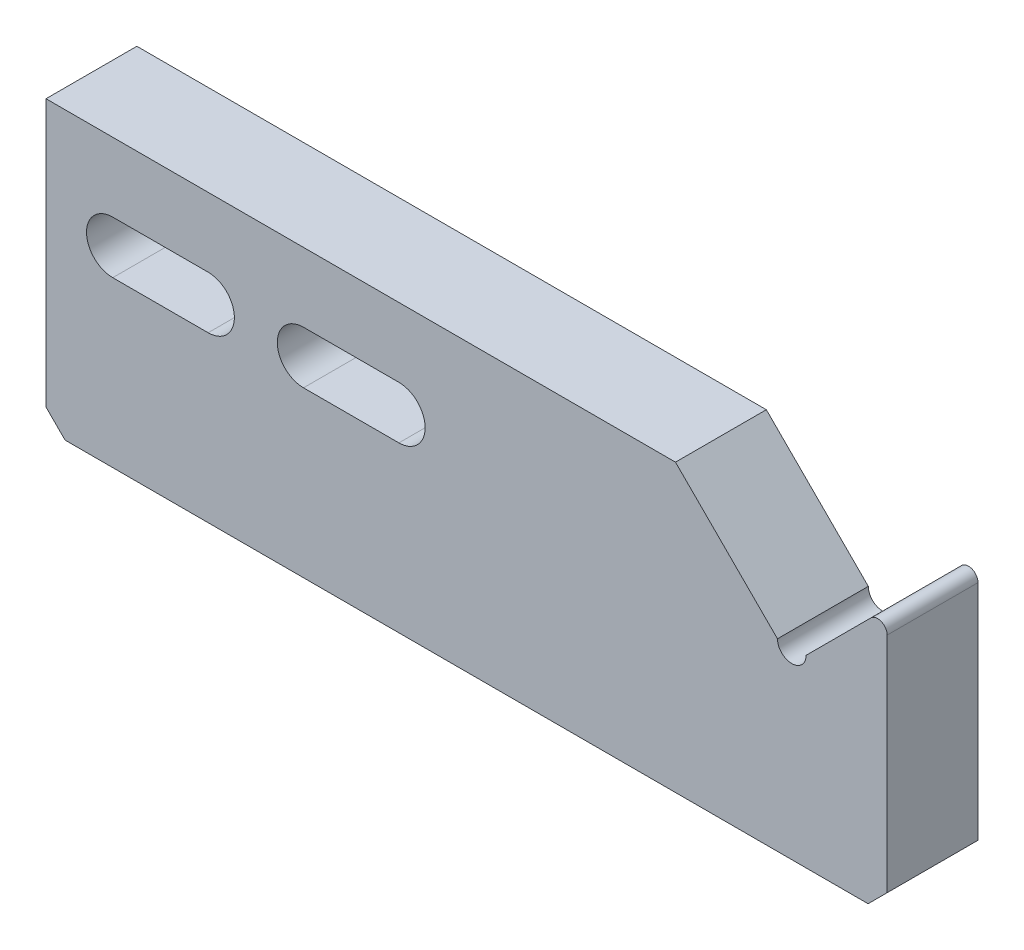
ISO-10303-21;
HEADER;
FILE_DESCRIPTION(('STEP AP214'),'2;1');
FILE_NAME('part.step','',(''),(''),'','','');
FILE_SCHEMA(('AUTOMOTIVE_DESIGN { 1 0 10303 214 1 1 1 1 }'));
ENDSEC;
DATA;
#1=APPLICATION_CONTEXT('core data for automotive mechanical design processes');
#2=APPLICATION_PROTOCOL_DEFINITION('international standard','automotive_design',2000,#1);
#3=PRODUCT_CONTEXT('',#1,'mechanical');
#4=PRODUCT('Part','Part','',(#3));
#5=PRODUCT_RELATED_PRODUCT_CATEGORY('part','',(#4));
#6=PRODUCT_DEFINITION_FORMATION('','',#4);
#7=PRODUCT_DEFINITION_CONTEXT('part definition',#1,'design');
#8=PRODUCT_DEFINITION('design','',#6,#7);
#9=PRODUCT_DEFINITION_SHAPE('','',#8);
#10=(LENGTH_UNIT() NAMED_UNIT(*) SI_UNIT(.MILLI.,.METRE.));
#11=(NAMED_UNIT(*) PLANE_ANGLE_UNIT() SI_UNIT($,.RADIAN.));
#12=(NAMED_UNIT(*) SI_UNIT($,.STERADIAN.) SOLID_ANGLE_UNIT());
#13=UNCERTAINTY_MEASURE_WITH_UNIT(LENGTH_MEASURE(1.E-05),#10,'distance_accuracy_value','');
#14=(GEOMETRIC_REPRESENTATION_CONTEXT(3) GLOBAL_UNCERTAINTY_ASSIGNED_CONTEXT((#13)) GLOBAL_UNIT_ASSIGNED_CONTEXT((#10,
#11,#12)) REPRESENTATION_CONTEXT('',''));
#15=CARTESIAN_POINT('',(0.,0.,0.));
#16=DIRECTION('',(0.,0.,1.));
#17=DIRECTION('',(1.,0.,0.));
#18=AXIS2_PLACEMENT_3D('',#15,#16,#17);
#19=CARTESIAN_POINT('',(-98.1923881554272,239.411254969543,-3.525));
#20=DIRECTION('',(-1.,0.,0.));
#21=DIRECTION('',(0.,0.,1.));
#22=AXIS2_PLACEMENT_3D('',#19,#20,#21);
#23=PLANE('',#22);
#24=CARTESIAN_POINT('',(-98.1923881554272,249.411254969543,1.2375));
#25=DIRECTION('',(-1.,0.,0.));
#26=DIRECTION('',(0.,0.,1.));
#27=AXIS2_PLACEMENT_3D('',#24,#25,#26);
#28=CIRCLE('',#27,2.00000000000002);
#29=CARTESIAN_POINT('',(-98.1923881554272,249.411254969543,3.23750000000002));
#30=VERTEX_POINT('',#29);
#31=EDGE_CURVE('E39',#30,#30,#28,.F.);
#32=ORIENTED_EDGE('',*,*,#31,.T.);
#33=EDGE_LOOP('',(#32));
#34=FACE_BOUND('',#33,.T.);
#35=DIRECTION('',(0.,-1.,0.));
#36=VECTOR('',#35,1.);
#37=CARTESIAN_POINT('',(-98.1923881554272,239.411254969543,-3.525));
#38=LINE('',#37,#36);
#39=CARTESIAN_POINT('',(-98.1923881554272,269.411254969543,-3.525));
#40=VERTEX_POINT('',#39);
#41=CARTESIAN_POINT('',(-98.1923881554272,241.411254969543,-3.525));
#42=VERTEX_POINT('',#41);
#43=EDGE_CURVE('E266',#40,#42,#38,.T.);
#44=ORIENTED_EDGE('',*,*,#43,.T.);
#45=DIRECTION('',(0.,0.,1.));
#46=VECTOR('',#45,1.);
#47=CARTESIAN_POINT('',(-98.1923881554272,241.411254969543,-3.525));
#48=LINE('',#47,#46);
#49=CARTESIAN_POINT('',(-98.1923881554272,241.411254969543,6.));
#50=VERTEX_POINT('',#49);
#51=EDGE_CURVE('E290',#42,#50,#48,.T.);
#52=ORIENTED_EDGE('',*,*,#51,.T.);
#53=DIRECTION('',(0.,-1.,0.));
#54=VECTOR('',#53,1.);
#55=CARTESIAN_POINT('',(-98.1923881554272,239.411254969543,6.));
#56=LINE('',#55,#54);
#57=CARTESIAN_POINT('',(-98.1923881554272,269.411254969543,6.));
#58=VERTEX_POINT('',#57);
#59=EDGE_CURVE('E207',#58,#50,#56,.T.);
#60=ORIENTED_EDGE('',*,*,#59,.F.);
#61=DIRECTION('',(0.,0.,1.));
#62=VECTOR('',#61,1.);
#63=CARTESIAN_POINT('',(-98.1923881554272,269.411254969543,-3.525));
#64=LINE('',#63,#62);
#65=EDGE_CURVE('E272',#40,#58,#64,.T.);
#66=ORIENTED_EDGE('',*,*,#65,.F.);
#67=EDGE_LOOP('',(#44,#52,#60,#66));
#68=FACE_BOUND('',#67,.T.);
#69=ADVANCED_FACE('F31',(#34,#68),#23,.T.);
#70=CARTESIAN_POINT('',(-10.,267.218866814118,-3.525));
#71=DIRECTION('',(1.,0.,0.));
#72=DIRECTION('',(0.,1.,0.));
#73=AXIS2_PLACEMENT_3D('',#70,#71,#72);
#74=PLANE('',#73);
#75=DIRECTION('',(0.,1.,0.));
#76=VECTOR('',#75,1.);
#77=CARTESIAN_POINT('',(-10.,267.218866814118,6.));
#78=LINE('',#77,#76);
#79=CARTESIAN_POINT('',(-10.,241.411254969543,6.));
#80=VERTEX_POINT('',#79);
#81=CARTESIAN_POINT('',(-10.,264.804653251745,6.));
#82=VERTEX_POINT('',#81);
#83=EDGE_CURVE('E194',#80,#82,#78,.T.);
#84=ORIENTED_EDGE('',*,*,#83,.F.);
#85=DIRECTION('',(0.,0.,-1.));
#86=VECTOR('',#85,1.);
#87=CARTESIAN_POINT('',(-10.,241.411254969543,-3.525));
#88=LINE('',#87,#86);
#89=CARTESIAN_POINT('',(-10.,241.411254969543,-3.525));
#90=VERTEX_POINT('',#89);
#91=EDGE_CURVE('E46',#80,#90,#88,.T.);
#92=ORIENTED_EDGE('',*,*,#91,.T.);
#93=DIRECTION('',(0.,1.,0.));
#94=VECTOR('',#93,1.);
#95=CARTESIAN_POINT('',(-10.,267.218866814118,-3.525));
#96=LINE('',#95,#94);
#97=CARTESIAN_POINT('',(-10.,264.804653251745,-3.525));
#98=VERTEX_POINT('',#97);
#99=EDGE_CURVE('E248',#90,#98,#96,.T.);
#100=ORIENTED_EDGE('',*,*,#99,.T.);
#101=DIRECTION('',(0.,0.,1.));
#102=VECTOR('',#101,1.);
#103=CARTESIAN_POINT('',(-10.,264.804653251745,-3.525));
#104=LINE('',#103,#102);
#105=EDGE_CURVE('E274',#98,#82,#104,.T.);
#106=ORIENTED_EDGE('',*,*,#105,.T.);
#107=EDGE_LOOP('',(#84,#92,#100,#106));
#108=FACE_BOUND('',#107,.T.);
#109=ADVANCED_FACE('F316',(#108),#74,.T.);
#110=CARTESIAN_POINT('',(-10.,239.411254969543,-3.525));
#111=DIRECTION('',(0.,-1.,0.));
#112=DIRECTION('',(1.,0.,0.));
#113=AXIS2_PLACEMENT_3D('',#110,#111,#112);
#114=PLANE('',#113);
#115=DIRECTION('',(1.,0.,0.));
#116=VECTOR('',#115,1.);
#117=CARTESIAN_POINT('',(-10.,239.411254969543,6.));
#118=LINE('',#117,#116);
#119=CARTESIAN_POINT('',(-96.1923881554272,239.411254969543,6.));
#120=VERTEX_POINT('',#119);
#121=CARTESIAN_POINT('',(-12.,239.411254969543,6.));
#122=VERTEX_POINT('',#121);
#123=EDGE_CURVE('E210',#120,#122,#118,.T.);
#124=ORIENTED_EDGE('',*,*,#123,.F.);
#125=DIRECTION('',(0.,0.,-1.));
#126=VECTOR('',#125,1.);
#127=CARTESIAN_POINT('',(-96.1923881554272,239.411254969543,-3.525));
#128=LINE('',#127,#126);
#129=CARTESIAN_POINT('',(-96.1923881554272,239.411254969543,-3.525));
#130=VERTEX_POINT('',#129);
#131=EDGE_CURVE('E300',#120,#130,#128,.T.);
#132=ORIENTED_EDGE('',*,*,#131,.T.);
#133=DIRECTION('',(1.,0.,0.));
#134=VECTOR('',#133,1.);
#135=CARTESIAN_POINT('',(-10.,239.411254969543,-3.525));
#136=LINE('',#135,#134);
#137=CARTESIAN_POINT('',(-12.,239.411254969543,-3.525));
#138=VERTEX_POINT('',#137);
#139=EDGE_CURVE('E269',#130,#138,#136,.T.);
#140=ORIENTED_EDGE('',*,*,#139,.T.);
#141=DIRECTION('',(0.,0.,1.));
#142=VECTOR('',#141,1.);
#143=CARTESIAN_POINT('',(-12.,239.411254969543,-3.525));
#144=LINE('',#143,#142);
#145=EDGE_CURVE('E297',#138,#122,#144,.T.);
#146=ORIENTED_EDGE('',*,*,#145,.T.);
#147=EDGE_LOOP('',(#124,#132,#140,#146));
#148=FACE_BOUND('',#147,.T.);
#149=ADVANCED_FACE('F321',(#148),#114,.T.);
#150=CARTESIAN_POINT('',(-98.1923881554272,269.411254969543,-3.525));
#151=DIRECTION('',(0.,1.,0.));
#152=DIRECTION('',(0.,0.,1.));
#153=AXIS2_PLACEMENT_3D('',#150,#151,#152);
#154=PLANE('',#153);
#155=ORIENTED_EDGE('',*,*,#65,.T.);
#156=DIRECTION('',(-1.,0.,0.));
#157=VECTOR('',#156,1.);
#158=CARTESIAN_POINT('',(-98.1923881554272,269.411254969543,6.));
#159=LINE('',#158,#157);
#160=CARTESIAN_POINT('',(-32.1923881554272,269.411254969543,6.));
#161=VERTEX_POINT('',#160);
#162=EDGE_CURVE('E204',#161,#58,#159,.T.);
#163=ORIENTED_EDGE('',*,*,#162,.F.);
#164=DIRECTION('',(0.,0.,1.));
#165=VECTOR('',#164,1.);
#166=CARTESIAN_POINT('',(-32.1923881554272,269.411254969543,-3.525));
#167=LINE('',#166,#165);
#168=CARTESIAN_POINT('',(-32.1923881554272,269.411254969543,-3.525));
#169=VERTEX_POINT('',#168);
#170=EDGE_CURVE('E275',#169,#161,#167,.T.);
#171=ORIENTED_EDGE('',*,*,#170,.F.);
#172=DIRECTION('',(-1.,0.,0.));
#173=VECTOR('',#172,1.);
#174=CARTESIAN_POINT('',(-98.1923881554272,269.411254969543,-3.525));
#175=LINE('',#174,#173);
#176=EDGE_CURVE('E263',#169,#40,#175,.T.);
#177=ORIENTED_EDGE('',*,*,#176,.T.);
#178=EDGE_LOOP('',(#155,#163,#171,#177));
#179=FACE_BOUND('',#178,.T.);
#180=ADVANCED_FACE('F326',(#179),#154,.T.);
#181=CARTESIAN_POINT('',(-32.1923881554272,269.411254969543,-3.525));
#182=DIRECTION('',(0.70710678118657,0.707106781186525,0.));
#183=DIRECTION('',(-0.707106781186525,0.70710678118657,0.));
#184=AXIS2_PLACEMENT_3D('',#181,#182,#183);
#185=PLANE('',#184);
#186=ORIENTED_EDGE('',*,*,#170,.T.);
#187=DIRECTION('',(-0.707106781186525,0.70710678118657,0.));
#188=VECTOR('',#187,1.);
#189=CARTESIAN_POINT('',(-32.1923881554272,269.411254969543,6.));
#190=LINE('',#189,#188);
#191=CARTESIAN_POINT('',(-21.5000000000015,258.718866814116,6.));
#192=VERTEX_POINT('',#191);
#193=EDGE_CURVE('E201',#192,#161,#190,.T.);
#194=ORIENTED_EDGE('',*,*,#193,.F.);
#195=DIRECTION('',(0.,0.,1.));
#196=VECTOR('',#195,1.);
#197=CARTESIAN_POINT('',(-21.5000000000015,258.718866814116,-3.525));
#198=LINE('',#197,#196);
#199=CARTESIAN_POINT('',(-21.5000000000015,258.718866814116,-3.525));
#200=VERTEX_POINT('',#199);
#201=EDGE_CURVE('E277',#200,#192,#198,.T.);
#202=ORIENTED_EDGE('',*,*,#201,.F.);
#203=DIRECTION('',(-0.707106781186525,0.70710678118657,0.));
#204=VECTOR('',#203,1.);
#205=CARTESIAN_POINT('',(-32.1923881554272,269.411254969543,-3.525));
#206=LINE('',#205,#204);
#207=EDGE_CURVE('E260',#200,#169,#206,.T.);
#208=ORIENTED_EDGE('',*,*,#207,.T.);
#209=EDGE_LOOP('',(#186,#194,#202,#208));
#210=FACE_BOUND('',#209,.T.);
#211=ADVANCED_FACE('F329',(#210),#185,.T.);
#212=CARTESIAN_POINT('',(-20.0000000000015,258.718866814116,-3.525));
#213=DIRECTION('',(0.,0.,1.));
#214=DIRECTION('',(1.,0.,0.));
#215=AXIS2_PLACEMENT_3D('',#212,#213,#214);
#216=CYLINDRICAL_SURFACE('',#215,1.5);
#217=ORIENTED_EDGE('',*,*,#201,.T.);
#218=CARTESIAN_POINT('',(-20.0000000000015,258.718866814116,6.));
#219=DIRECTION('',(0.,0.,-1.));
#220=DIRECTION('',(1.,0.,0.));
#221=AXIS2_PLACEMENT_3D('',#218,#219,#220);
#222=CIRCLE('',#221,1.5);
#223=CARTESIAN_POINT('',(-18.5000000000015,258.718866814116,6.));
#224=VERTEX_POINT('',#223);
#225=EDGE_CURVE('E198',#224,#192,#222,.T.);
#226=ORIENTED_EDGE('',*,*,#225,.F.);
#227=DIRECTION('',(0.,0.,1.));
#228=VECTOR('',#227,1.);
#229=CARTESIAN_POINT('',(-18.5000000000015,258.718866814116,-3.525));
#230=LINE('',#229,#228);
#231=CARTESIAN_POINT('',(-18.5000000000015,258.718866814116,-3.525));
#232=VERTEX_POINT('',#231);
#233=EDGE_CURVE('E271',#232,#224,#230,.T.);
#234=ORIENTED_EDGE('',*,*,#233,.F.);
#235=CARTESIAN_POINT('',(-20.0000000000015,258.718866814116,-3.525));
#236=DIRECTION('',(0.,0.,-1.));
#237=DIRECTION('',(1.,0.,0.));
#238=AXIS2_PLACEMENT_3D('',#235,#236,#237);
#239=CIRCLE('',#238,1.5);
#240=EDGE_CURVE('E257',#232,#200,#239,.T.);
#241=ORIENTED_EDGE('',*,*,#240,.T.);
#242=EDGE_LOOP('',(#217,#226,#234,#241));
#243=FACE_BOUND('',#242,.T.);
#244=ADVANCED_FACE('F333',(#243),#216,.F.);
#245=CARTESIAN_POINT('',(-10.,267.218866814118,-3.525));
#246=DIRECTION('',(-0.707106781186548,0.707106781186547,0.));
#247=DIRECTION('',(-0.707106781186547,-0.707106781186548,0.));
#248=AXIS2_PLACEMENT_3D('',#245,#246,#247);
#249=PLANE('',#248);
#250=DIRECTION('',(-0.707106781186547,-0.707106781186548,0.));
#251=VECTOR('',#250,1.);
#252=CARTESIAN_POINT('',(-10.,267.218866814118,6.));
#253=LINE('',#252,#251);
#254=CARTESIAN_POINT('',(-11.7071067811866,265.511760032931,6.));
#255=VERTEX_POINT('',#254);
#256=EDGE_CURVE('E196',#255,#224,#253,.T.);
#257=ORIENTED_EDGE('',*,*,#256,.F.);
#258=DIRECTION('',(0.,0.,1.));
#259=VECTOR('',#258,1.);
#260=CARTESIAN_POINT('',(-11.7071067811866,265.511760032931,-3.525));
#261=LINE('',#260,#259);
#262=CARTESIAN_POINT('',(-11.7071067811866,265.511760032931,-3.525));
#263=VERTEX_POINT('',#262);
#264=EDGE_CURVE('E285',#255,#263,#261,.F.);
#265=ORIENTED_EDGE('',*,*,#264,.T.);
#266=DIRECTION('',(-0.707106781186547,-0.707106781186548,0.));
#267=VECTOR('',#266,1.);
#268=CARTESIAN_POINT('',(-10.,267.218866814118,-3.525));
#269=LINE('',#268,#267);
#270=EDGE_CURVE('E255',#263,#232,#269,.T.);
#271=ORIENTED_EDGE('',*,*,#270,.T.);
#272=ORIENTED_EDGE('',*,*,#233,.T.);
#273=EDGE_LOOP('',(#257,#265,#271,#272));
#274=FACE_BOUND('',#273,.T.);
#275=ADVANCED_FACE('F337',(#274),#249,.T.);
#276=CARTESIAN_POINT('',(-20.0000000000015,258.718866814116,-3.525));
#277=DIRECTION('',(0.,0.,1.));
#278=DIRECTION('',(1.,0.,0.));
#279=AXIS2_PLACEMENT_3D('',#276,#277,#278);
#280=PLANE('',#279);
#281=DIRECTION('',(1.,0.,0.));
#282=VECTOR('',#281,1.);
#283=CARTESIAN_POINT('',(-61.1923881554272,256.661254969543,-3.525));
#284=LINE('',#283,#282);
#285=CARTESIAN_POINT('',(-71.1923881554272,256.661254969543,-3.525));
#286=VERTEX_POINT('',#285);
#287=CARTESIAN_POINT('',(-61.1923881554272,256.661254969543,-3.525));
#288=VERTEX_POINT('',#287);
#289=EDGE_CURVE('E222',#286,#288,#284,.T.);
#290=ORIENTED_EDGE('',*,*,#289,.T.);
#291=CARTESIAN_POINT('',(-61.1923881554272,259.411254969543,-3.525));
#292=DIRECTION('',(0.,0.,1.));
#293=DIRECTION('',(1.,0.,0.));
#294=AXIS2_PLACEMENT_3D('',#291,#292,#293);
#295=CIRCLE('',#294,2.75);
#296=CARTESIAN_POINT('',(-61.1923881554272,262.161254969543,-3.525));
#297=VERTEX_POINT('',#296);
#298=EDGE_CURVE('E213',#288,#297,#295,.T.);
#299=ORIENTED_EDGE('',*,*,#298,.T.);
#300=DIRECTION('',(-1.,0.,0.));
#301=VECTOR('',#300,1.);
#302=CARTESIAN_POINT('',(-61.1923881554272,262.161254969543,-3.525));
#303=LINE('',#302,#301);
#304=CARTESIAN_POINT('',(-71.1923881554272,262.161254969543,-3.525));
#305=VERTEX_POINT('',#304);
#306=EDGE_CURVE('E216',#297,#305,#303,.T.);
#307=ORIENTED_EDGE('',*,*,#306,.T.);
#308=CARTESIAN_POINT('',(-71.1923881554272,259.411254969543,-3.525));
#309=DIRECTION('',(0.,0.,1.));
#310=DIRECTION('',(1.,0.,0.));
#311=AXIS2_PLACEMENT_3D('',#308,#309,#310);
#312=CIRCLE('',#311,2.75000000000003);
#313=EDGE_CURVE('E219',#305,#286,#312,.T.);
#314=ORIENTED_EDGE('',*,*,#313,.T.);
#315=EDGE_LOOP('',(#290,#299,#307,#314));
#316=FACE_BOUND('',#315,.T.);
#317=DIRECTION('',(1.,0.,0.));
#318=VECTOR('',#317,1.);
#319=CARTESIAN_POINT('',(-81.1923881554272,256.661254969543,-3.525));
#320=LINE('',#319,#318);
#321=CARTESIAN_POINT('',(-91.1923881554272,256.661254969543,-3.525));
#322=VERTEX_POINT('',#321);
#323=CARTESIAN_POINT('',(-81.1923881554272,256.661254969543,-3.525));
#324=VERTEX_POINT('',#323);
#325=EDGE_CURVE('E242',#322,#324,#320,.T.);
#326=ORIENTED_EDGE('',*,*,#325,.T.);
#327=CARTESIAN_POINT('',(-81.1923881554272,259.411254969543,-3.525));
#328=DIRECTION('',(0.,0.,1.));
#329=DIRECTION('',(1.,0.,0.));
#330=AXIS2_PLACEMENT_3D('',#327,#328,#329);
#331=CIRCLE('',#330,2.75000000000003);
#332=CARTESIAN_POINT('',(-81.1923881554272,262.161254969543,-3.525));
#333=VERTEX_POINT('',#332);
#334=EDGE_CURVE('E228',#324,#333,#331,.T.);
#335=ORIENTED_EDGE('',*,*,#334,.T.);
#336=DIRECTION('',(-1.,0.,0.));
#337=VECTOR('',#336,1.);
#338=CARTESIAN_POINT('',(-81.1923881554272,262.161254969543,-3.525));
#339=LINE('',#338,#337);
#340=CARTESIAN_POINT('',(-91.1923881554272,262.161254969543,-3.525));
#341=VERTEX_POINT('',#340);
#342=EDGE_CURVE('E236',#333,#341,#339,.T.);
#343=ORIENTED_EDGE('',*,*,#342,.T.);
#344=CARTESIAN_POINT('',(-91.1923881554272,259.411254969543,-3.525));
#345=DIRECTION('',(0.,0.,1.));
#346=DIRECTION('',(1.,0.,0.));
#347=AXIS2_PLACEMENT_3D('',#344,#345,#346);
#348=CIRCLE('',#347,2.75000000000003);
#349=EDGE_CURVE('E239',#341,#322,#348,.T.);
#350=ORIENTED_EDGE('',*,*,#349,.T.);
#351=EDGE_LOOP('',(#326,#335,#343,#350));
#352=FACE_BOUND('',#351,.T.);
#353=ORIENTED_EDGE('',*,*,#139,.F.);
#354=DIRECTION('',(0.707106781186548,-0.707106781186548,0.));
#355=VECTOR('',#354,1.);
#356=CARTESIAN_POINT('',(-98.1923881554272,241.411254969543,-3.525));
#357=LINE('',#356,#355);
#358=EDGE_CURVE('E303',#130,#42,#357,.F.);
#359=ORIENTED_EDGE('',*,*,#358,.T.);
#360=ORIENTED_EDGE('',*,*,#43,.F.);
#361=ORIENTED_EDGE('',*,*,#176,.F.);
#362=ORIENTED_EDGE('',*,*,#207,.F.);
#363=ORIENTED_EDGE('',*,*,#240,.F.);
#364=ORIENTED_EDGE('',*,*,#270,.F.);
#365=CARTESIAN_POINT('',(-11.,264.804653251745,-3.525));
#366=DIRECTION('',(0.,0.,1.));
#367=DIRECTION('',(1.,0.,0.));
#368=AXIS2_PLACEMENT_3D('',#365,#366,#367);
#369=CIRCLE('',#368,1.);
#370=EDGE_CURVE('E287',#263,#98,#369,.F.);
#371=ORIENTED_EDGE('',*,*,#370,.T.);
#372=ORIENTED_EDGE('',*,*,#99,.F.);
#373=DIRECTION('',(0.707106781186548,0.707106781186548,0.));
#374=VECTOR('',#373,1.);
#375=CARTESIAN_POINT('',(-12.,239.411254969543,-3.525));
#376=LINE('',#375,#374);
#377=EDGE_CURVE('E53',#90,#138,#376,.F.);
#378=ORIENTED_EDGE('',*,*,#377,.T.);
#379=EDGE_LOOP('',(#353,#359,#360,#361,#362,#363,#364,#371,#372,#378));
#380=FACE_BOUND('',#379,.T.);
#381=ADVANCED_FACE('F340',(#316,#352,#380),#280,.F.);
#382=CARTESIAN_POINT('',(-81.1923881554272,259.411254969543,-3.525));
#383=DIRECTION('',(0.,0.,1.));
#384=DIRECTION('',(1.,0.,0.));
#385=AXIS2_PLACEMENT_3D('',#382,#383,#384);
#386=CYLINDRICAL_SURFACE('',#385,2.75000000000003);
#387=DIRECTION('',(0.,0.,1.));
#388=VECTOR('',#387,1.);
#389=CARTESIAN_POINT('',(-81.1923881554272,256.661254969543,-3.525));
#390=LINE('',#389,#388);
#391=CARTESIAN_POINT('',(-81.1923881554272,256.661254969543,6.));
#392=VERTEX_POINT('',#391);
#393=EDGE_CURVE('E246',#324,#392,#390,.T.);
#394=ORIENTED_EDGE('',*,*,#393,.T.);
#395=CARTESIAN_POINT('',(-81.1923881554272,259.411254969543,6.));
#396=DIRECTION('',(0.,0.,1.));
#397=DIRECTION('',(1.,0.,0.));
#398=AXIS2_PLACEMENT_3D('',#395,#396,#397);
#399=CIRCLE('',#398,2.75000000000003);
#400=CARTESIAN_POINT('',(-81.1923881554272,262.161254969543,6.));
#401=VERTEX_POINT('',#400);
#402=EDGE_CURVE('E182',#392,#401,#399,.T.);
#403=ORIENTED_EDGE('',*,*,#402,.T.);
#404=DIRECTION('',(0.,0.,1.));
#405=VECTOR('',#404,1.);
#406=CARTESIAN_POINT('',(-81.1923881554272,262.161254969543,-3.525));
#407=LINE('',#406,#405);
#408=EDGE_CURVE('E245',#333,#401,#407,.T.);
#409=ORIENTED_EDGE('',*,*,#408,.F.);
#410=ORIENTED_EDGE('',*,*,#334,.F.);
#411=EDGE_LOOP('',(#394,#403,#409,#410));
#412=FACE_BOUND('',#411,.T.);
#413=ADVANCED_FACE('F383',(#412),#386,.F.);
#414=CARTESIAN_POINT('',(-81.1923881554272,256.661254969543,-3.525));
#415=DIRECTION('',(0.,-1.,0.));
#416=DIRECTION('',(0.,0.,-1.));
#417=AXIS2_PLACEMENT_3D('',#414,#415,#416);
#418=PLANE('',#417);
#419=DIRECTION('',(0.,0.,1.));
#420=VECTOR('',#419,1.);
#421=CARTESIAN_POINT('',(-91.1923881554272,256.661254969543,-3.525));
#422=LINE('',#421,#420);
#423=CARTESIAN_POINT('',(-91.1923881554272,256.661254969543,6.));
#424=VERTEX_POINT('',#423);
#425=EDGE_CURVE('E249',#322,#424,#422,.T.);
#426=ORIENTED_EDGE('',*,*,#425,.T.);
#427=DIRECTION('',(1.,0.,0.));
#428=VECTOR('',#427,1.);
#429=CARTESIAN_POINT('',(-81.1923881554272,256.661254969543,6.));
#430=LINE('',#429,#428);
#431=EDGE_CURVE('E191',#424,#392,#430,.T.);
#432=ORIENTED_EDGE('',*,*,#431,.T.);
#433=ORIENTED_EDGE('',*,*,#393,.F.);
#434=ORIENTED_EDGE('',*,*,#325,.F.);
#435=EDGE_LOOP('',(#426,#432,#433,#434));
#436=FACE_BOUND('',#435,.T.);
#437=ADVANCED_FACE('F388',(#436),#418,.F.);
#438=CARTESIAN_POINT('',(-91.1923881554272,259.411254969543,-3.525));
#439=DIRECTION('',(0.,0.,1.));
#440=DIRECTION('',(1.,0.,0.));
#441=AXIS2_PLACEMENT_3D('',#438,#439,#440);
#442=CYLINDRICAL_SURFACE('',#441,2.75000000000003);
#443=DIRECTION('',(0.,0.,1.));
#444=VECTOR('',#443,1.);
#445=CARTESIAN_POINT('',(-91.1923881554272,262.161254969543,-3.525));
#446=LINE('',#445,#444);
#447=CARTESIAN_POINT('',(-91.1923881554272,262.161254969543,6.));
#448=VERTEX_POINT('',#447);
#449=EDGE_CURVE('E251',#341,#448,#446,.T.);
#450=ORIENTED_EDGE('',*,*,#449,.T.);
#451=CARTESIAN_POINT('',(-91.1923881554272,259.411254969543,6.));
#452=DIRECTION('',(0.,0.,1.));
#453=DIRECTION('',(1.,0.,0.));
#454=AXIS2_PLACEMENT_3D('',#451,#452,#453);
#455=CIRCLE('',#454,2.75000000000003);
#456=EDGE_CURVE('E188',#448,#424,#455,.T.);
#457=ORIENTED_EDGE('',*,*,#456,.T.);
#458=ORIENTED_EDGE('',*,*,#425,.F.);
#459=ORIENTED_EDGE('',*,*,#349,.F.);
#460=EDGE_LOOP('',(#450,#457,#458,#459));
#461=FACE_BOUND('',#460,.T.);
#462=ADVANCED_FACE('F397',(#461),#442,.F.);
#463=CARTESIAN_POINT('',(-81.1923881554272,262.161254969543,-3.525));
#464=DIRECTION('',(0.,1.,0.));
#465=DIRECTION('',(0.,0.,1.));
#466=AXIS2_PLACEMENT_3D('',#463,#464,#465);
#467=PLANE('',#466);
#468=ORIENTED_EDGE('',*,*,#408,.T.);
#469=DIRECTION('',(-1.,0.,0.));
#470=VECTOR('',#469,1.);
#471=CARTESIAN_POINT('',(-81.1923881554272,262.161254969543,6.));
#472=LINE('',#471,#470);
#473=EDGE_CURVE('E185',#401,#448,#472,.T.);
#474=ORIENTED_EDGE('',*,*,#473,.T.);
#475=ORIENTED_EDGE('',*,*,#449,.F.);
#476=ORIENTED_EDGE('',*,*,#342,.F.);
#477=EDGE_LOOP('',(#468,#474,#475,#476));
#478=FACE_BOUND('',#477,.T.);
#479=ADVANCED_FACE('F393',(#478),#467,.F.);
#480=CARTESIAN_POINT('',(-61.1923881554272,259.411254969543,-3.525));
#481=DIRECTION('',(0.,0.,1.));
#482=DIRECTION('',(1.,0.,0.));
#483=AXIS2_PLACEMENT_3D('',#480,#481,#482);
#484=CYLINDRICAL_SURFACE('',#483,2.75);
#485=DIRECTION('',(0.,0.,1.));
#486=VECTOR('',#485,1.);
#487=CARTESIAN_POINT('',(-61.1923881554272,256.661254969543,-3.525));
#488=LINE('',#487,#486);
#489=CARTESIAN_POINT('',(-61.1923881554272,256.661254969543,6.));
#490=VERTEX_POINT('',#489);
#491=EDGE_CURVE('E226',#288,#490,#488,.T.);
#492=ORIENTED_EDGE('',*,*,#491,.T.);
#493=CARTESIAN_POINT('',(-61.1923881554272,259.411254969543,6.));
#494=DIRECTION('',(0.,0.,1.));
#495=DIRECTION('',(1.,0.,0.));
#496=AXIS2_PLACEMENT_3D('',#493,#494,#495);
#497=CIRCLE('',#496,2.75);
#498=CARTESIAN_POINT('',(-61.1923881554272,262.161254969543,6.));
#499=VERTEX_POINT('',#498);
#500=EDGE_CURVE('E168',#490,#499,#497,.T.);
#501=ORIENTED_EDGE('',*,*,#500,.T.);
#502=DIRECTION('',(0.,0.,1.));
#503=VECTOR('',#502,1.);
#504=CARTESIAN_POINT('',(-61.1923881554272,262.161254969543,-3.525));
#505=LINE('',#504,#503);
#506=EDGE_CURVE('E225',#297,#499,#505,.T.);
#507=ORIENTED_EDGE('',*,*,#506,.F.);
#508=ORIENTED_EDGE('',*,*,#298,.F.);
#509=EDGE_LOOP('',(#492,#501,#507,#508));
#510=FACE_BOUND('',#509,.T.);
#511=ADVANCED_FACE('F396',(#510),#484,.F.);
#512=CARTESIAN_POINT('',(-61.1923881554272,256.661254969543,-3.525));
#513=DIRECTION('',(0.,-1.,0.));
#514=DIRECTION('',(0.,0.,-1.));
#515=AXIS2_PLACEMENT_3D('',#512,#513,#514);
#516=PLANE('',#515);
#517=DIRECTION('',(0.,0.,1.));
#518=VECTOR('',#517,1.);
#519=CARTESIAN_POINT('',(-71.1923881554272,256.661254969543,-3.525));
#520=LINE('',#519,#518);
#521=CARTESIAN_POINT('',(-71.1923881554272,256.661254969543,6.));
#522=VERTEX_POINT('',#521);
#523=EDGE_CURVE('E229',#286,#522,#520,.T.);
#524=ORIENTED_EDGE('',*,*,#523,.T.);
#525=DIRECTION('',(1.,0.,0.));
#526=VECTOR('',#525,1.);
#527=CARTESIAN_POINT('',(-61.1923881554272,256.661254969543,6.));
#528=LINE('',#527,#526);
#529=EDGE_CURVE('E179',#522,#490,#528,.T.);
#530=ORIENTED_EDGE('',*,*,#529,.T.);
#531=ORIENTED_EDGE('',*,*,#491,.F.);
#532=ORIENTED_EDGE('',*,*,#289,.F.);
#533=EDGE_LOOP('',(#524,#530,#531,#532));
#534=FACE_BOUND('',#533,.T.);
#535=ADVANCED_FACE('F407',(#534),#516,.F.);
#536=CARTESIAN_POINT('',(-71.1923881554272,259.411254969543,-3.525));
#537=DIRECTION('',(0.,0.,1.));
#538=DIRECTION('',(1.,0.,0.));
#539=AXIS2_PLACEMENT_3D('',#536,#537,#538);
#540=CYLINDRICAL_SURFACE('',#539,2.75000000000003);
#541=DIRECTION('',(0.,0.,1.));
#542=VECTOR('',#541,1.);
#543=CARTESIAN_POINT('',(-71.1923881554272,262.161254969543,-3.525));
#544=LINE('',#543,#542);
#545=CARTESIAN_POINT('',(-71.1923881554272,262.161254969543,6.));
#546=VERTEX_POINT('',#545);
#547=EDGE_CURVE('E231',#305,#546,#544,.T.);
#548=ORIENTED_EDGE('',*,*,#547,.T.);
#549=CARTESIAN_POINT('',(-71.1923881554272,259.411254969543,6.));
#550=DIRECTION('',(0.,0.,1.));
#551=DIRECTION('',(1.,0.,0.));
#552=AXIS2_PLACEMENT_3D('',#549,#550,#551);
#553=CIRCLE('',#552,2.75000000000003);
#554=EDGE_CURVE('E176',#546,#522,#553,.T.);
#555=ORIENTED_EDGE('',*,*,#554,.T.);
#556=ORIENTED_EDGE('',*,*,#523,.F.);
#557=ORIENTED_EDGE('',*,*,#313,.F.);
#558=EDGE_LOOP('',(#548,#555,#556,#557));
#559=FACE_BOUND('',#558,.T.);
#560=ADVANCED_FACE('F412',(#559),#540,.F.);
#561=CARTESIAN_POINT('',(-61.1923881554272,262.161254969543,-3.525));
#562=DIRECTION('',(0.,1.,0.));
#563=DIRECTION('',(-1.,0.,0.));
#564=AXIS2_PLACEMENT_3D('',#561,#562,#563);
#565=PLANE('',#564);
#566=ORIENTED_EDGE('',*,*,#506,.T.);
#567=DIRECTION('',(-1.,0.,0.));
#568=VECTOR('',#567,1.);
#569=CARTESIAN_POINT('',(-61.1923881554272,262.161254969543,6.));
#570=LINE('',#569,#568);
#571=EDGE_CURVE('E171',#499,#546,#570,.T.);
#572=ORIENTED_EDGE('',*,*,#571,.T.);
#573=ORIENTED_EDGE('',*,*,#547,.F.);
#574=ORIENTED_EDGE('',*,*,#306,.F.);
#575=EDGE_LOOP('',(#566,#572,#573,#574));
#576=FACE_BOUND('',#575,.T.);
#577=ADVANCED_FACE('F409',(#576),#565,.F.);
#578=CARTESIAN_POINT('',(-20.0000000000015,258.718866814116,6.));
#579=DIRECTION('',(0.,0.,1.));
#580=DIRECTION('',(1.,0.,0.));
#581=AXIS2_PLACEMENT_3D('',#578,#579,#580);
#582=PLANE('',#581);
#583=ORIENTED_EDGE('',*,*,#473,.F.);
#584=ORIENTED_EDGE('',*,*,#402,.F.);
#585=ORIENTED_EDGE('',*,*,#431,.F.);
#586=ORIENTED_EDGE('',*,*,#456,.F.);
#587=EDGE_LOOP('',(#583,#584,#585,#586));
#588=FACE_BOUND('',#587,.T.);
#589=ORIENTED_EDGE('',*,*,#59,.T.);
#590=DIRECTION('',(-0.707106781186548,0.707106781186548,0.));
#591=VECTOR('',#590,1.);
#592=CARTESIAN_POINT('',(-67.7500000000011,210.968866814117,6.));
#593=LINE('',#592,#591);
#594=EDGE_CURVE('E295',#50,#120,#593,.F.);
#595=ORIENTED_EDGE('',*,*,#594,.T.);
#596=ORIENTED_EDGE('',*,*,#123,.T.);
#597=DIRECTION('',(-0.707106781186548,-0.707106781186548,0.));
#598=VECTOR('',#597,1.);
#599=CARTESIAN_POINT('',(-6.34619407771401,245.065060891829,6.));
#600=LINE('',#599,#598);
#601=EDGE_CURVE('E293',#122,#80,#600,.F.);
#602=ORIENTED_EDGE('',*,*,#601,.T.);
#603=ORIENTED_EDGE('',*,*,#83,.T.);
#604=CARTESIAN_POINT('',(-11.,264.804653251745,6.));
#605=DIRECTION('',(0.,0.,1.));
#606=DIRECTION('',(1.,0.,0.));
#607=AXIS2_PLACEMENT_3D('',#604,#605,#606);
#608=CIRCLE('',#607,1.);
#609=EDGE_CURVE('E283',#82,#255,#608,.T.);
#610=ORIENTED_EDGE('',*,*,#609,.T.);
#611=ORIENTED_EDGE('',*,*,#256,.T.);
#612=ORIENTED_EDGE('',*,*,#225,.T.);
#613=ORIENTED_EDGE('',*,*,#193,.T.);
#614=ORIENTED_EDGE('',*,*,#162,.T.);
#615=EDGE_LOOP('',(#589,#595,#596,#602,#603,#610,#611,#612,#613,#614));
#616=FACE_BOUND('',#615,.T.);
#617=ORIENTED_EDGE('',*,*,#571,.F.);
#618=ORIENTED_EDGE('',*,*,#500,.F.);
#619=ORIENTED_EDGE('',*,*,#529,.F.);
#620=ORIENTED_EDGE('',*,*,#554,.F.);
#621=EDGE_LOOP('',(#617,#618,#619,#620));
#622=FACE_BOUND('',#621,.T.);
#623=ADVANCED_FACE('F347',(#588,#616,#622),#582,.T.);
#624=CARTESIAN_POINT('',(-11.,264.804653251745,-3.525));
#625=DIRECTION('',(0.,0.,1.));
#626=DIRECTION('',(1.,0.,0.));
#627=AXIS2_PLACEMENT_3D('',#624,#625,#626);
#628=CYLINDRICAL_SURFACE('',#627,1.);
#629=ORIENTED_EDGE('',*,*,#370,.F.);
#630=ORIENTED_EDGE('',*,*,#264,.F.);
#631=ORIENTED_EDGE('',*,*,#609,.F.);
#632=ORIENTED_EDGE('',*,*,#105,.F.);
#633=EDGE_LOOP('',(#629,#630,#631,#632));
#634=FACE_BOUND('',#633,.T.);
#635=ADVANCED_FACE('F343',(#634),#628,.T.);
#636=CARTESIAN_POINT('',(-98.1923881554272,241.411254969543,-3.525));
#637=DIRECTION('',(0.707106781186547,0.707106781186547,0.));
#638=DIRECTION('',(-0.707106781186548,0.707106781186548,0.));
#639=AXIS2_PLACEMENT_3D('',#636,#637,#638);
#640=PLANE('',#639);
#641=ORIENTED_EDGE('',*,*,#358,.F.);
#642=ORIENTED_EDGE('',*,*,#131,.F.);
#643=ORIENTED_EDGE('',*,*,#594,.F.);
#644=ORIENTED_EDGE('',*,*,#51,.F.);
#645=EDGE_LOOP('',(#641,#642,#643,#644));
#646=FACE_BOUND('',#645,.T.);
#647=ADVANCED_FACE('F346',(#646),#640,.F.);
#648=CARTESIAN_POINT('',(-12.,239.411254969543,-3.525));
#649=DIRECTION('',(-0.707106781186547,0.707106781186547,0.));
#650=DIRECTION('',(-0.707106781186548,-0.707106781186548,0.));
#651=AXIS2_PLACEMENT_3D('',#648,#649,#650);
#652=PLANE('',#651);
#653=ORIENTED_EDGE('',*,*,#377,.F.);
#654=ORIENTED_EDGE('',*,*,#91,.F.);
#655=ORIENTED_EDGE('',*,*,#601,.F.);
#656=ORIENTED_EDGE('',*,*,#145,.F.);
#657=EDGE_LOOP('',(#653,#654,#655,#656));
#658=FACE_BOUND('',#657,.T.);
#659=ADVANCED_FACE('F350',(#658),#652,.F.);
#660=CARTESIAN_POINT('',(-98.1923881554272,249.411254969543,1.2375));
#661=DIRECTION('',(1.,0.,0.));
#662=DIRECTION('',(0.,0.,-1.));
#663=AXIS2_PLACEMENT_3D('',#660,#661,#662);
#664=CYLINDRICAL_SURFACE('',#663,1.5);
#665=CARTESIAN_POINT('',(-97.6923881554272,249.411254969543,1.2375));
#666=DIRECTION('',(-1.,0.,0.));
#667=DIRECTION('',(0.,0.,1.));
#668=AXIS2_PLACEMENT_3D('',#665,#666,#667);
#669=CIRCLE('',#668,1.5);
#670=CARTESIAN_POINT('',(-97.6923881554272,249.411254969543,2.7375));
#671=VERTEX_POINT('',#670);
#672=EDGE_CURVE('E11',#671,#671,#669,.T.);
#673=ORIENTED_EDGE('',*,*,#672,.T.);
#674=EDGE_LOOP('',(#673));
#675=FACE_BOUND('',#674,.T.);
#676=CARTESIAN_POINT('',(-78.1923881554272,249.411254969543,1.2375));
#677=DIRECTION('',(1.,0.,0.));
#678=DIRECTION('',(0.,0.,-1.));
#679=AXIS2_PLACEMENT_3D('',#676,#677,#678);
#680=CIRCLE('',#679,1.5);
#681=CARTESIAN_POINT('',(-78.1923881554272,249.411254969543,-0.262500000000001));
#682=VERTEX_POINT('',#681);
#683=EDGE_CURVE('E166',#682,#682,#680,.T.);
#684=ORIENTED_EDGE('',*,*,#683,.T.);
#685=EDGE_LOOP('',(#684));
#686=FACE_BOUND('',#685,.T.);
#687=ADVANCED_FACE('F162',(#675,#686),#664,.F.);
#688=CARTESIAN_POINT('',(-78.1923881554272,249.411254969543,1.2375));
#689=DIRECTION('',(-1.,0.,0.));
#690=DIRECTION('',(0.,0.,1.));
#691=AXIS2_PLACEMENT_3D('',#688,#689,#690);
#692=CONICAL_SURFACE('',#691,1.5,1.0471975511966);
#693=CARTESIAN_POINT('',(-77.3263627516428,249.411254969543,1.2375));
#694=VERTEX_POINT('',#693);
#695=VERTEX_LOOP('',#694);
#696=FACE_BOUND('',#695,.T.);
#697=ORIENTED_EDGE('',*,*,#683,.F.);
#698=EDGE_LOOP('',(#697));
#699=FACE_BOUND('',#698,.T.);
#700=ADVANCED_FACE('F159',(#696,#699),#692,.F.);
#701=CARTESIAN_POINT('',(-98.1923881554272,249.411254969543,1.2375));
#702=DIRECTION('',(-1.,0.,0.));
#703=DIRECTION('',(0.,0.,1.));
#704=AXIS2_PLACEMENT_3D('',#701,#702,#703);
#705=CONICAL_SURFACE('',#704,2.00000000000002,0.785398163397448);
#706=ORIENTED_EDGE('',*,*,#672,.F.);
#707=EDGE_LOOP('',(#706));
#708=FACE_BOUND('',#707,.T.);
#709=ORIENTED_EDGE('',*,*,#31,.F.);
#710=EDGE_LOOP('',(#709));
#711=FACE_BOUND('',#710,.T.);
#712=ADVANCED_FACE('F33',(#708,#711),#705,.F.);
#713=CLOSED_SHELL('',(#69,#109,#149,#180,#211,#244,#275,#381,#413,#437,#462,#479,#511,#535,#560,
#577,#623,#635,#647,#659,#687,#700,#712));
#714=MANIFOLD_SOLID_BREP('B2',#713);
#715=ADVANCED_BREP_SHAPE_REPRESENTATION('',(#18,#714),#14);
#716=SHAPE_DEFINITION_REPRESENTATION(#9,#715);
ENDSEC;
END-ISO-10303-21;
